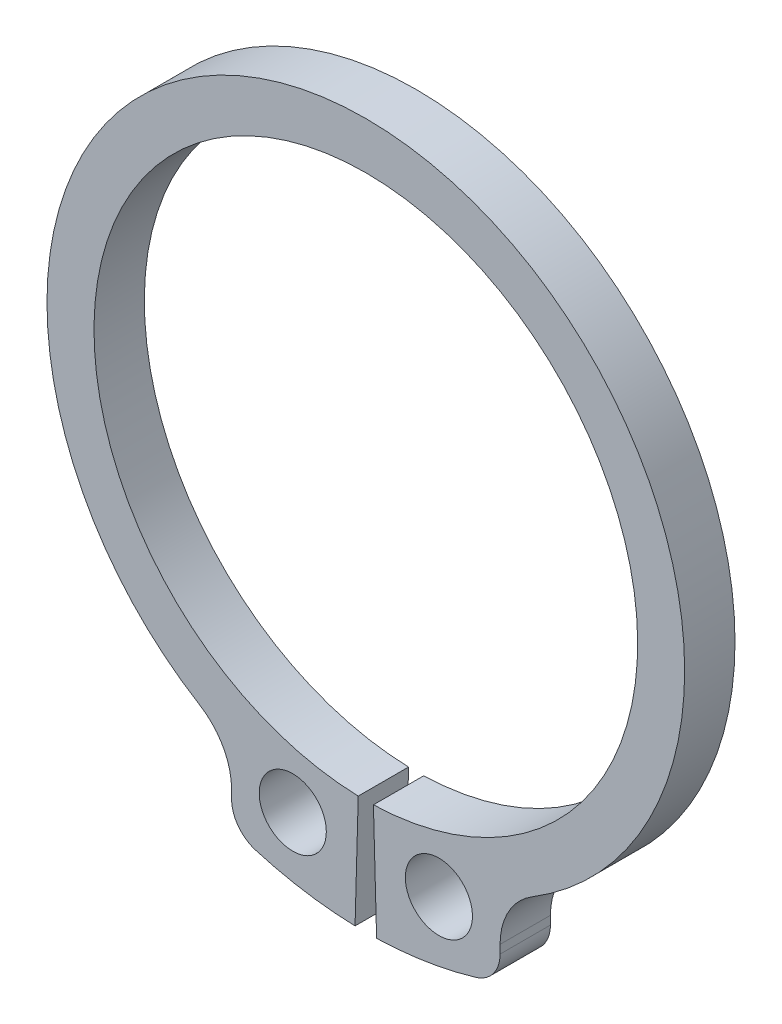
ISO-10303-21;
HEADER;
FILE_DESCRIPTION(('STEP AP214'),'2;1');
FILE_NAME('part.step','',(''),(''),'','','');
FILE_SCHEMA(('AUTOMOTIVE_DESIGN { 1 0 10303 214 1 1 1 1 }'));
ENDSEC;
DATA;
#1=APPLICATION_CONTEXT('core data for automotive mechanical design processes');
#2=APPLICATION_PROTOCOL_DEFINITION('international standard','automotive_design',2000,#1);
#3=PRODUCT_CONTEXT('',#1,'mechanical');
#4=PRODUCT('Part','Part','',(#3));
#5=PRODUCT_RELATED_PRODUCT_CATEGORY('part','',(#4));
#6=PRODUCT_DEFINITION_FORMATION('','',#4);
#7=PRODUCT_DEFINITION_CONTEXT('part definition',#1,'design');
#8=PRODUCT_DEFINITION('design','',#6,#7);
#9=PRODUCT_DEFINITION_SHAPE('','',#8);
#10=(LENGTH_UNIT() NAMED_UNIT(*) SI_UNIT(.MILLI.,.METRE.));
#11=(NAMED_UNIT(*) PLANE_ANGLE_UNIT() SI_UNIT($,.RADIAN.));
#12=(NAMED_UNIT(*) SI_UNIT($,.STERADIAN.) SOLID_ANGLE_UNIT());
#13=UNCERTAINTY_MEASURE_WITH_UNIT(LENGTH_MEASURE(1.E-05),#10,'distance_accuracy_value','');
#14=(GEOMETRIC_REPRESENTATION_CONTEXT(3) GLOBAL_UNCERTAINTY_ASSIGNED_CONTEXT((#13)) GLOBAL_UNIT_ASSIGNED_CONTEXT((#10,
#11,#12)) REPRESENTATION_CONTEXT('',''));
#15=CARTESIAN_POINT('',(0.,0.,0.));
#16=DIRECTION('',(0.,0.,1.));
#17=DIRECTION('',(1.,0.,0.));
#18=AXIS2_PLACEMENT_3D('',#15,#16,#17);
#19=CARTESIAN_POINT('',(6.00000000000004,-9.81070843517422,1.5));
#20=DIRECTION('',(0.,0.,-0.999999999999997));
#21=DIRECTION('',(-1.,0.,0.));
#22=AXIS2_PLACEMENT_3D('',#19,#20,#21);
#23=CYLINDRICAL_SURFACE('',#22,2.);
#24=CARTESIAN_POINT('',(6.00000000000001,-9.81070843517428,0.));
#25=DIRECTION('',(0.,0.,-0.999999999999997));
#26=DIRECTION('',(-1.,0.,0.));
#27=AXIS2_PLACEMENT_3D('',#24,#25,#26);
#28=CIRCLE('',#27,2.);
#29=CARTESIAN_POINT('',(3.99999999999998,-9.81070843517426,0.));
#30=VERTEX_POINT('',#29);
#31=CARTESIAN_POINT('',(4.95652173913042,-8.10449827253529,0.));
#32=VERTEX_POINT('',#31);
#33=EDGE_CURVE('E166',#30,#32,#28,.T.);
#34=ORIENTED_EDGE('',*,*,#33,.T.);
#35=DIRECTION('',(0.,0.,-0.999999999999997));
#36=VECTOR('',#35,1.);
#37=CARTESIAN_POINT('',(4.95652173913046,-8.10449827253524,1.5));
#38=LINE('',#37,#36);
#39=CARTESIAN_POINT('',(4.95652173913046,-8.10449827253524,1.5));
#40=VERTEX_POINT('',#39);
#41=EDGE_CURVE('E13',#40,#32,#38,.T.);
#42=ORIENTED_EDGE('',*,*,#41,.F.);
#43=CARTESIAN_POINT('',(6.00000000000004,-9.81070843517422,1.5));
#44=DIRECTION('',(0.,0.,-0.999999999999997));
#45=DIRECTION('',(-1.,0.,0.));
#46=AXIS2_PLACEMENT_3D('',#43,#44,#45);
#47=CIRCLE('',#46,2.);
#48=CARTESIAN_POINT('',(4.00000000000004,-9.81070843517422,1.5));
#49=VERTEX_POINT('',#48);
#50=EDGE_CURVE('E196',#49,#40,#47,.T.);
#51=ORIENTED_EDGE('',*,*,#50,.F.);
#52=DIRECTION('',(0.,0.,-0.999999999999997));
#53=VECTOR('',#52,1.);
#54=CARTESIAN_POINT('',(4.00000000000004,-9.81070843517422,1.5));
#55=LINE('',#54,#53);
#56=EDGE_CURVE('E162',#49,#30,#55,.T.);
#57=ORIENTED_EDGE('',*,*,#56,.T.);
#58=EDGE_LOOP('',(#34,#42,#51,#57));
#59=FACE_BOUND('',#58,.T.);
#60=ADVANCED_FACE('F46',(#59),#23,.F.);
#61=CARTESIAN_POINT('',(0.,0.,1.5));
#62=DIRECTION('',(0.,0.,-0.999999999999997));
#63=DIRECTION('',(-1.,0.,0.));
#64=AXIS2_PLACEMENT_3D('',#61,#62,#63);
#65=CYLINDRICAL_SURFACE('',#64,9.5);
#66=CARTESIAN_POINT('',(0.,0.,0.));
#67=DIRECTION('',(0.,0.,0.999999999999997));
#68=DIRECTION('',(1.,0.,0.));
#69=AXIS2_PLACEMENT_3D('',#66,#67,#68);
#70=CIRCLE('',#69,9.5);
#71=CARTESIAN_POINT('',(-4.95652173913045,-8.10449827253527,3.33066907387547E-13));
#72=VERTEX_POINT('',#71);
#73=EDGE_CURVE('E169',#32,#72,#70,.T.);
#74=ORIENTED_EDGE('',*,*,#73,.T.);
#75=DIRECTION('',(0.,0.,-0.999999999999997));
#76=VECTOR('',#75,1.);
#77=CARTESIAN_POINT('',(-4.95652173913041,-8.10449827253524,1.50000000000033));
#78=LINE('',#77,#76);
#79=CARTESIAN_POINT('',(-4.95652173913041,-8.10449827253524,1.50000000000033));
#80=VERTEX_POINT('',#79);
#81=EDGE_CURVE('E54',#80,#72,#78,.T.);
#82=ORIENTED_EDGE('',*,*,#81,.F.);
#83=CARTESIAN_POINT('',(0.,0.,1.5));
#84=DIRECTION('',(0.,0.,0.999999999999997));
#85=DIRECTION('',(1.,0.,0.));
#86=AXIS2_PLACEMENT_3D('',#83,#84,#85);
#87=CIRCLE('',#86,9.5);
#88=EDGE_CURVE('E117',#40,#80,#87,.T.);
#89=ORIENTED_EDGE('',*,*,#88,.F.);
#90=ORIENTED_EDGE('',*,*,#41,.T.);
#91=EDGE_LOOP('',(#74,#82,#89,#90));
#92=FACE_BOUND('',#91,.T.);
#93=ADVANCED_FACE('F218',(#92),#65,.T.);
#94=CARTESIAN_POINT('',(-5.99999999999998,-9.81070843517425,1.5));
#95=DIRECTION('',(0.,0.,-0.999999999999997));
#96=DIRECTION('',(-1.,0.,0.));
#97=AXIS2_PLACEMENT_3D('',#94,#95,#96);
#98=CYLINDRICAL_SURFACE('',#97,2.);
#99=CARTESIAN_POINT('',(-6.,-9.81070843517428,0.));
#100=DIRECTION('',(0.,0.,0.999999999999997));
#101=DIRECTION('',(1.,0.,0.));
#102=AXIS2_PLACEMENT_3D('',#99,#100,#101);
#103=CIRCLE('',#102,2.);
#104=CARTESIAN_POINT('',(-4.,-9.81070843517429,0.));
#105=VERTEX_POINT('',#104);
#106=EDGE_CURVE('E173',#105,#72,#103,.T.);
#107=ORIENTED_EDGE('',*,*,#106,.F.);
#108=DIRECTION('',(0.,0.,-0.999999999999997));
#109=VECTOR('',#108,1.);
#110=CARTESIAN_POINT('',(-3.99999999999998,-9.81070843517424,1.5));
#111=LINE('',#110,#109);
#112=CARTESIAN_POINT('',(-3.99999999999998,-9.81070843517424,1.5));
#113=VERTEX_POINT('',#112);
#114=EDGE_CURVE('E211',#113,#105,#111,.T.);
#115=ORIENTED_EDGE('',*,*,#114,.F.);
#116=CARTESIAN_POINT('',(-5.99999999999998,-9.81070843517425,1.5));
#117=DIRECTION('',(0.,0.,0.999999999999997));
#118=DIRECTION('',(1.,0.,0.));
#119=AXIS2_PLACEMENT_3D('',#116,#117,#118);
#120=CIRCLE('',#119,2.);
#121=EDGE_CURVE('E217',#113,#80,#120,.T.);
#122=ORIENTED_EDGE('',*,*,#121,.T.);
#123=ORIENTED_EDGE('',*,*,#81,.T.);
#124=EDGE_LOOP('',(#107,#115,#122,#123));
#125=FACE_BOUND('',#124,.T.);
#126=ADVANCED_FACE('F215',(#125),#98,.F.);
#127=CARTESIAN_POINT('',(-3.99999999999998,-10.062305898749,1.5));
#128=DIRECTION('',(-1.,0.,0.));
#129=DIRECTION('',(0.,0.,0.999999999999997));
#130=AXIS2_PLACEMENT_3D('',#127,#128,#129);
#131=PLANE('',#130);
#132=DIRECTION('',(0.,0.999999999999998,0.));
#133=VECTOR('',#132,1.);
#134=CARTESIAN_POINT('',(-4.,-10.0623058987491,0.));
#135=LINE('',#134,#133);
#136=CARTESIAN_POINT('',(-4.,-10.0623058987491,0.));
#137=VERTEX_POINT('',#136);
#138=EDGE_CURVE('E176',#137,#105,#135,.T.);
#139=ORIENTED_EDGE('',*,*,#138,.F.);
#140=DIRECTION('',(0.,0.,-0.999999999999997));
#141=VECTOR('',#140,1.);
#142=CARTESIAN_POINT('',(-3.99999999999998,-10.062305898749,1.5));
#143=LINE('',#142,#141);
#144=CARTESIAN_POINT('',(-3.99999999999998,-10.062305898749,1.5));
#145=VERTEX_POINT('',#144);
#146=EDGE_CURVE('E209',#145,#137,#143,.T.);
#147=ORIENTED_EDGE('',*,*,#146,.F.);
#148=DIRECTION('',(0.,0.999999999999998,0.));
#149=VECTOR('',#148,1.);
#150=CARTESIAN_POINT('',(-3.99999999999998,-10.062305898749,1.5));
#151=LINE('',#150,#149);
#152=EDGE_CURVE('E230',#145,#113,#151,.T.);
#153=ORIENTED_EDGE('',*,*,#152,.T.);
#154=ORIENTED_EDGE('',*,*,#114,.T.);
#155=EDGE_LOOP('',(#139,#147,#153,#154));
#156=FACE_BOUND('',#155,.T.);
#157=ADVANCED_FACE('F227',(#156),#131,.T.);
#158=CARTESIAN_POINT('',(-2.99999999999997,-10.062305898749,1.5));
#159=DIRECTION('',(0.,0.,-0.999999999999997));
#160=DIRECTION('',(-1.,0.,0.));
#161=AXIS2_PLACEMENT_3D('',#158,#159,#160);
#162=CYLINDRICAL_SURFACE('',#161,1.);
#163=CARTESIAN_POINT('',(-2.99999999999999,-10.062305898749,0.));
#164=DIRECTION('',(0.,0.,-0.999999999999997));
#165=DIRECTION('',(-1.,0.,0.));
#166=AXIS2_PLACEMENT_3D('',#163,#164,#165);
#167=CIRCLE('',#166,1.);
#168=CARTESIAN_POINT('',(-3.28571428571428,-11.0206207462489,0.));
#169=VERTEX_POINT('',#168);
#170=EDGE_CURVE('E179',#169,#137,#167,.T.);
#171=ORIENTED_EDGE('',*,*,#170,.F.);
#172=DIRECTION('',(0.,0.,-0.999999999999997));
#173=VECTOR('',#172,1.);
#174=CARTESIAN_POINT('',(-3.28571428571427,-11.0206207462489,1.5));
#175=LINE('',#174,#173);
#176=CARTESIAN_POINT('',(-3.28571428571427,-11.0206207462489,1.5));
#177=VERTEX_POINT('',#176);
#178=EDGE_CURVE('E207',#177,#169,#175,.T.);
#179=ORIENTED_EDGE('',*,*,#178,.F.);
#180=CARTESIAN_POINT('',(-2.99999999999997,-10.062305898749,1.5));
#181=DIRECTION('',(0.,0.,-0.999999999999997));
#182=DIRECTION('',(-1.,0.,0.));
#183=AXIS2_PLACEMENT_3D('',#180,#181,#182);
#184=CIRCLE('',#183,1.);
#185=EDGE_CURVE('E234',#177,#145,#184,.T.);
#186=ORIENTED_EDGE('',*,*,#185,.T.);
#187=ORIENTED_EDGE('',*,*,#146,.T.);
#188=EDGE_LOOP('',(#171,#179,#186,#187));
#189=FACE_BOUND('',#188,.T.);
#190=ADVANCED_FACE('F274',(#189),#162,.T.);
#191=CARTESIAN_POINT('',(0.,0.,1.5));
#192=DIRECTION('',(0.,0.,-0.999999999999997));
#193=DIRECTION('',(-1.,0.,0.));
#194=AXIS2_PLACEMENT_3D('',#191,#192,#193);
#195=CYLINDRICAL_SURFACE('',#194,11.5);
#196=CARTESIAN_POINT('',(0.,0.,0.));
#197=DIRECTION('',(0.,0.,0.999999999999997));
#198=DIRECTION('',(1.,0.,0.));
#199=AXIS2_PLACEMENT_3D('',#196,#197,#198);
#200=CIRCLE('',#199,11.5);
#201=CARTESIAN_POINT('',(-0.321098845320965,-11.4955163229641,0.));
#202=VERTEX_POINT('',#201);
#203=EDGE_CURVE('E182',#169,#202,#200,.T.);
#204=ORIENTED_EDGE('',*,*,#203,.T.);
#205=DIRECTION('',(0.,0.,-0.999999999999997));
#206=VECTOR('',#205,1.);
#207=CARTESIAN_POINT('',(-0.321098845320937,-11.495516322964,1.5));
#208=LINE('',#207,#206);
#209=CARTESIAN_POINT('',(-0.321098845320937,-11.495516322964,1.5));
#210=VERTEX_POINT('',#209);
#211=EDGE_CURVE('E204',#210,#202,#208,.T.);
#212=ORIENTED_EDGE('',*,*,#211,.F.);
#213=CARTESIAN_POINT('',(0.,0.,1.5));
#214=DIRECTION('',(0.,0.,0.999999999999997));
#215=DIRECTION('',(1.,0.,0.));
#216=AXIS2_PLACEMENT_3D('',#213,#214,#215);
#217=CIRCLE('',#216,11.5);
#218=EDGE_CURVE('E240',#177,#210,#217,.T.);
#219=ORIENTED_EDGE('',*,*,#218,.F.);
#220=ORIENTED_EDGE('',*,*,#178,.T.);
#221=EDGE_LOOP('',(#204,#212,#219,#220));
#222=FACE_BOUND('',#221,.T.);
#223=ADVANCED_FACE('F277',(#222),#195,.T.);
#224=CARTESIAN_POINT('',(-0.32109884532093,-11.495516322964,1.5));
#225=DIRECTION('',(-0.999610115040355,0.0279216387235616,0.));
#226=DIRECTION('',(-0.0279216387235617,-0.999610115040352,0.));
#227=AXIS2_PLACEMENT_3D('',#224,#225,#226);
#228=PLANE('',#227);
#229=DIRECTION('',(0.0279216387235617,0.999610115040352,0.));
#230=VECTOR('',#229,1.);
#231=CARTESIAN_POINT('',(-0.32109884532093,-11.495516322964,0.));
#232=LINE('',#231,#230);
#233=CARTESIAN_POINT('',(-0.226165273660851,-8.09684193182684,0.));
#234=VERTEX_POINT('',#233);
#235=EDGE_CURVE('E184',#202,#234,#232,.T.);
#236=ORIENTED_EDGE('',*,*,#235,.T.);
#237=DIRECTION('',(0.,0.,-0.999999999999997));
#238=VECTOR('',#237,1.);
#239=CARTESIAN_POINT('',(-0.226165273660831,-8.09684193182682,1.5));
#240=LINE('',#239,#238);
#241=CARTESIAN_POINT('',(-0.226165273660831,-8.09684193182682,1.5));
#242=VERTEX_POINT('',#241);
#243=EDGE_CURVE('E202',#242,#234,#240,.T.);
#244=ORIENTED_EDGE('',*,*,#243,.F.);
#245=DIRECTION('',(0.0279216387235617,0.999610115040352,0.));
#246=VECTOR('',#245,1.);
#247=CARTESIAN_POINT('',(-0.32109884532093,-11.495516322964,1.5));
#248=LINE('',#247,#246);
#249=EDGE_CURVE('E242',#210,#242,#248,.T.);
#250=ORIENTED_EDGE('',*,*,#249,.F.);
#251=ORIENTED_EDGE('',*,*,#211,.T.);
#252=EDGE_LOOP('',(#236,#244,#250,#251));
#253=FACE_BOUND('',#252,.T.);
#254=ADVANCED_FACE('F281',(#253),#228,.F.);
#255=CARTESIAN_POINT('',(0.,0.,1.5));
#256=DIRECTION('',(0.,0.,-0.999999999999997));
#257=DIRECTION('',(-1.,0.,0.));
#258=AXIS2_PLACEMENT_3D('',#255,#256,#257);
#259=CYLINDRICAL_SURFACE('',#258,8.1);
#260=CARTESIAN_POINT('',(0.,0.,0.));
#261=DIRECTION('',(0.,0.,0.999999999999997));
#262=DIRECTION('',(1.,0.,0.));
#263=AXIS2_PLACEMENT_3D('',#260,#261,#262);
#264=CIRCLE('',#263,8.1);
#265=CARTESIAN_POINT('',(0.226165273660851,-8.09684193182687,0.));
#266=VERTEX_POINT('',#265);
#267=EDGE_CURVE('E187',#266,#234,#264,.T.);
#268=ORIENTED_EDGE('',*,*,#267,.F.);
#269=DIRECTION('',(0.,0.,-0.999999999999997));
#270=VECTOR('',#269,1.);
#271=CARTESIAN_POINT('',(0.226165273660872,-8.09684193182683,1.5));
#272=LINE('',#271,#270);
#273=CARTESIAN_POINT('',(0.226165273660872,-8.09684193182683,1.5));
#274=VERTEX_POINT('',#273);
#275=EDGE_CURVE('E200',#274,#266,#272,.T.);
#276=ORIENTED_EDGE('',*,*,#275,.F.);
#277=CARTESIAN_POINT('',(0.,0.,1.5));
#278=DIRECTION('',(0.,0.,0.999999999999997));
#279=DIRECTION('',(1.,0.,0.));
#280=AXIS2_PLACEMENT_3D('',#277,#278,#279);
#281=CIRCLE('',#280,8.1);
#282=EDGE_CURVE('E244',#274,#242,#281,.T.);
#283=ORIENTED_EDGE('',*,*,#282,.T.);
#284=ORIENTED_EDGE('',*,*,#243,.T.);
#285=EDGE_LOOP('',(#268,#276,#283,#284));
#286=FACE_BOUND('',#285,.T.);
#287=ADVANCED_FACE('F285',(#286),#259,.F.);
#288=CARTESIAN_POINT('',(0.321098845320979,-11.495516322964,1.5));
#289=DIRECTION('',(-0.999610115040354,-0.0279216387235618,0.));
#290=DIRECTION('',(0.0279216387235617,-0.999610115040352,0.));
#291=AXIS2_PLACEMENT_3D('',#288,#289,#290);
#292=PLANE('',#291);
#293=DIRECTION('',(-0.0279216387235617,0.999610115040352,0.));
#294=VECTOR('',#293,1.);
#295=CARTESIAN_POINT('',(0.321098845320972,-11.495516322964,0.));
#296=LINE('',#295,#294);
#297=CARTESIAN_POINT('',(0.321098845320972,-11.495516322964,0.));
#298=VERTEX_POINT('',#297);
#299=EDGE_CURVE('E190',#298,#266,#296,.T.);
#300=ORIENTED_EDGE('',*,*,#299,.F.);
#301=DIRECTION('',(0.,0.,-0.999999999999997));
#302=VECTOR('',#301,1.);
#303=CARTESIAN_POINT('',(0.321098845320979,-11.495516322964,1.5));
#304=LINE('',#303,#302);
#305=CARTESIAN_POINT('',(0.321098845320979,-11.495516322964,1.5));
#306=VERTEX_POINT('',#305);
#307=EDGE_CURVE('E157',#306,#298,#304,.T.);
#308=ORIENTED_EDGE('',*,*,#307,.F.);
#309=DIRECTION('',(-0.0279216387235617,0.999610115040352,0.));
#310=VECTOR('',#309,1.);
#311=CARTESIAN_POINT('',(0.321098845320979,-11.495516322964,1.5));
#312=LINE('',#311,#310);
#313=EDGE_CURVE('E150',#306,#274,#312,.T.);
#314=ORIENTED_EDGE('',*,*,#313,.T.);
#315=ORIENTED_EDGE('',*,*,#275,.T.);
#316=EDGE_LOOP('',(#300,#308,#314,#315));
#317=FACE_BOUND('',#316,.T.);
#318=ADVANCED_FACE('F248',(#317),#292,.T.);
#319=CARTESIAN_POINT('',(0.,0.,1.5));
#320=DIRECTION('',(0.,0.,-0.999999999999997));
#321=DIRECTION('',(-1.,0.,0.));
#322=AXIS2_PLACEMENT_3D('',#319,#320,#321);
#323=CYLINDRICAL_SURFACE('',#322,11.5);
#324=CARTESIAN_POINT('',(0.,0.,0.));
#325=DIRECTION('',(0.,0.,0.999999999999997));
#326=DIRECTION('',(1.,0.,0.));
#327=AXIS2_PLACEMENT_3D('',#324,#325,#326);
#328=CIRCLE('',#327,11.5);
#329=CARTESIAN_POINT('',(3.28571428571429,-11.020620746249,0.));
#330=VERTEX_POINT('',#329);
#331=EDGE_CURVE('E156',#298,#330,#328,.T.);
#332=ORIENTED_EDGE('',*,*,#331,.T.);
#333=DIRECTION('',(0.,0.,-0.999999999999997));
#334=VECTOR('',#333,1.);
#335=CARTESIAN_POINT('',(3.28571428571431,-11.0206207462489,1.5));
#336=LINE('',#335,#334);
#337=CARTESIAN_POINT('',(3.28571428571431,-11.0206207462489,1.5));
#338=VERTEX_POINT('',#337);
#339=EDGE_CURVE('E153',#338,#330,#336,.T.);
#340=ORIENTED_EDGE('',*,*,#339,.F.);
#341=CARTESIAN_POINT('',(0.,0.,1.5));
#342=DIRECTION('',(0.,0.,0.999999999999997));
#343=DIRECTION('',(1.,0.,0.));
#344=AXIS2_PLACEMENT_3D('',#341,#342,#343);
#345=CIRCLE('',#344,11.5);
#346=EDGE_CURVE('E143',#306,#338,#345,.T.);
#347=ORIENTED_EDGE('',*,*,#346,.F.);
#348=ORIENTED_EDGE('',*,*,#307,.T.);
#349=EDGE_LOOP('',(#332,#340,#347,#348));
#350=FACE_BOUND('',#349,.T.);
#351=ADVANCED_FACE('F154',(#350),#323,.T.);
#352=CARTESIAN_POINT('',(3.00000000000001,-10.062305898749,1.5));
#353=DIRECTION('',(0.,0.,-0.999999999999997));
#354=DIRECTION('',(-1.,0.,0.));
#355=AXIS2_PLACEMENT_3D('',#352,#353,#354);
#356=CYLINDRICAL_SURFACE('',#355,1.);
#357=CARTESIAN_POINT('',(3.00000000000002,-10.062305898749,0.));
#358=DIRECTION('',(0.,0.,0.999999999999997));
#359=DIRECTION('',(1.,0.,0.));
#360=AXIS2_PLACEMENT_3D('',#357,#358,#359);
#361=CIRCLE('',#360,1.);
#362=CARTESIAN_POINT('',(3.99999999999999,-10.062305898749,0.));
#363=VERTEX_POINT('',#362);
#364=EDGE_CURVE('E103',#330,#363,#361,.T.);
#365=ORIENTED_EDGE('',*,*,#364,.T.);
#366=DIRECTION('',(0.,0.,-0.999999999999997));
#367=VECTOR('',#366,1.);
#368=CARTESIAN_POINT('',(4.,-10.062305898749,1.5));
#369=LINE('',#368,#367);
#370=CARTESIAN_POINT('',(4.,-10.062305898749,1.5));
#371=VERTEX_POINT('',#370);
#372=EDGE_CURVE('E158',#371,#363,#369,.T.);
#373=ORIENTED_EDGE('',*,*,#372,.F.);
#374=CARTESIAN_POINT('',(3.00000000000001,-10.062305898749,1.5));
#375=DIRECTION('',(0.,0.,0.999999999999997));
#376=DIRECTION('',(1.,0.,0.));
#377=AXIS2_PLACEMENT_3D('',#374,#375,#376);
#378=CIRCLE('',#377,1.);
#379=EDGE_CURVE('E147',#338,#371,#378,.T.);
#380=ORIENTED_EDGE('',*,*,#379,.F.);
#381=ORIENTED_EDGE('',*,*,#339,.T.);
#382=EDGE_LOOP('',(#365,#373,#380,#381));
#383=FACE_BOUND('',#382,.T.);
#384=ADVANCED_FACE('F160',(#383),#356,.T.);
#385=CARTESIAN_POINT('',(4.,-10.062305898749,1.5));
#386=DIRECTION('',(-1.,0.,0.));
#387=DIRECTION('',(0.,0.,0.999999999999997));
#388=AXIS2_PLACEMENT_3D('',#385,#386,#387);
#389=PLANE('',#388);
#390=DIRECTION('',(0.,0.999999999999998,0.));
#391=VECTOR('',#390,1.);
#392=CARTESIAN_POINT('',(3.99999999999999,-10.062305898749,0.));
#393=LINE('',#392,#391);
#394=EDGE_CURVE('E109',#363,#30,#393,.T.);
#395=ORIENTED_EDGE('',*,*,#394,.T.);
#396=ORIENTED_EDGE('',*,*,#56,.F.);
#397=DIRECTION('',(0.,0.999999999999998,0.));
#398=VECTOR('',#397,1.);
#399=CARTESIAN_POINT('',(4.,-10.062305898749,1.5));
#400=LINE('',#399,#398);
#401=EDGE_CURVE('E62',#371,#49,#400,.T.);
#402=ORIENTED_EDGE('',*,*,#401,.F.);
#403=ORIENTED_EDGE('',*,*,#372,.T.);
#404=EDGE_LOOP('',(#395,#396,#402,#403));
#405=FACE_BOUND('',#404,.T.);
#406=ADVANCED_FACE('F252',(#405),#389,.F.);
#407=CARTESIAN_POINT('',(6.00000000000004,-9.81070843517422,1.5));
#408=DIRECTION('',(0.,0.,-0.999999999999997));
#409=DIRECTION('',(-1.,0.,0.));
#410=AXIS2_PLACEMENT_3D('',#407,#408,#409);
#411=PLANE('',#410);
#412=CARTESIAN_POINT('',(2.17704790340786,-9.49462843593591,1.5));
#413=DIRECTION('',(0.,0.,-0.999999999999997));
#414=DIRECTION('',(-1.,0.,0.));
#415=AXIS2_PLACEMENT_3D('',#412,#413,#414);
#416=CIRCLE('',#415,1.);
#417=CARTESIAN_POINT('',(1.17704790340786,-9.49462843593591,1.5));
#418=VERTEX_POINT('',#417);
#419=EDGE_CURVE('E170',#418,#418,#416,.T.);
#420=ORIENTED_EDGE('',*,*,#419,.T.);
#421=EDGE_LOOP('',(#420));
#422=FACE_BOUND('',#421,.T.);
#423=CARTESIAN_POINT('',(-2.17704790340781,-9.49462843593589,1.5));
#424=DIRECTION('',(0.,0.,-0.999999999999997));
#425=DIRECTION('',(1.,0.,0.));
#426=AXIS2_PLACEMENT_3D('',#423,#424,#425);
#427=CIRCLE('',#426,1.);
#428=CARTESIAN_POINT('',(-1.17704790340781,-9.49462843593589,1.5));
#429=VERTEX_POINT('',#428);
#430=EDGE_CURVE('E337',#429,#429,#427,.T.);
#431=ORIENTED_EDGE('',*,*,#430,.T.);
#432=EDGE_LOOP('',(#431));
#433=FACE_BOUND('',#432,.T.);
#434=ORIENTED_EDGE('',*,*,#50,.T.);
#435=ORIENTED_EDGE('',*,*,#88,.T.);
#436=ORIENTED_EDGE('',*,*,#121,.F.);
#437=ORIENTED_EDGE('',*,*,#152,.F.);
#438=ORIENTED_EDGE('',*,*,#185,.F.);
#439=ORIENTED_EDGE('',*,*,#218,.T.);
#440=ORIENTED_EDGE('',*,*,#249,.T.);
#441=ORIENTED_EDGE('',*,*,#282,.F.);
#442=ORIENTED_EDGE('',*,*,#313,.F.);
#443=ORIENTED_EDGE('',*,*,#346,.T.);
#444=ORIENTED_EDGE('',*,*,#379,.T.);
#445=ORIENTED_EDGE('',*,*,#401,.T.);
#446=EDGE_LOOP('',(#434,#435,#436,#437,#438,#439,#440,#441,#442,#443,#444,#445));
#447=FACE_BOUND('',#446,.T.);
#448=ADVANCED_FACE('F145',(#422,#433,#447),#411,.F.);
#449=CARTESIAN_POINT('',(6.00000000000001,-9.81070843517428,0.));
#450=DIRECTION('',(0.,0.,-0.999999999999997));
#451=DIRECTION('',(-1.,0.,0.));
#452=AXIS2_PLACEMENT_3D('',#449,#450,#451);
#453=PLANE('',#452);
#454=CARTESIAN_POINT('',(2.17704790340781,-9.49462843593592,0.));
#455=DIRECTION('',(0.,0.,-0.999999999999997));
#456=DIRECTION('',(-1.,0.,0.));
#457=AXIS2_PLACEMENT_3D('',#454,#455,#456);
#458=CIRCLE('',#457,1.);
#459=CARTESIAN_POINT('',(1.17704790340781,-9.49462843593592,0.));
#460=VERTEX_POINT('',#459);
#461=EDGE_CURVE('E336',#460,#460,#458,.T.);
#462=ORIENTED_EDGE('',*,*,#461,.F.);
#463=EDGE_LOOP('',(#462));
#464=FACE_BOUND('',#463,.T.);
#465=CARTESIAN_POINT('',(-2.17704790340783,-9.49462843593595,0.));
#466=DIRECTION('',(0.,0.,-0.999999999999997));
#467=DIRECTION('',(1.,0.,0.));
#468=AXIS2_PLACEMENT_3D('',#465,#466,#467);
#469=CIRCLE('',#468,1.);
#470=CARTESIAN_POINT('',(-1.17704790340783,-9.49462843593595,0.));
#471=VERTEX_POINT('',#470);
#472=EDGE_CURVE('E341',#471,#471,#469,.T.);
#473=ORIENTED_EDGE('',*,*,#472,.F.);
#474=EDGE_LOOP('',(#473));
#475=FACE_BOUND('',#474,.T.);
#476=ORIENTED_EDGE('',*,*,#33,.F.);
#477=ORIENTED_EDGE('',*,*,#394,.F.);
#478=ORIENTED_EDGE('',*,*,#364,.F.);
#479=ORIENTED_EDGE('',*,*,#331,.F.);
#480=ORIENTED_EDGE('',*,*,#299,.T.);
#481=ORIENTED_EDGE('',*,*,#267,.T.);
#482=ORIENTED_EDGE('',*,*,#235,.F.);
#483=ORIENTED_EDGE('',*,*,#203,.F.);
#484=ORIENTED_EDGE('',*,*,#170,.T.);
#485=ORIENTED_EDGE('',*,*,#138,.T.);
#486=ORIENTED_EDGE('',*,*,#106,.T.);
#487=ORIENTED_EDGE('',*,*,#73,.F.);
#488=EDGE_LOOP('',(#476,#477,#478,#479,#480,#481,#482,#483,#484,#485,#486,#487));
#489=FACE_BOUND('',#488,.T.);
#490=ADVANCED_FACE('F222',(#464,#475,#489),#453,.T.);
#491=CARTESIAN_POINT('',(-2.17704790340781,-9.49462843593589,1.5));
#492=DIRECTION('',(0.,0.,-0.999999999999997));
#493=DIRECTION('',(-1.,0.,0.));
#494=AXIS2_PLACEMENT_3D('',#491,#492,#493);
#495=CYLINDRICAL_SURFACE('',#494,1.);
#496=ORIENTED_EDGE('',*,*,#430,.F.);
#497=EDGE_LOOP('',(#496));
#498=FACE_BOUND('',#497,.T.);
#499=ORIENTED_EDGE('',*,*,#472,.T.);
#500=EDGE_LOOP('',(#499));
#501=FACE_BOUND('',#500,.T.);
#502=ADVANCED_FACE('F314',(#498,#501),#495,.F.);
#503=CARTESIAN_POINT('',(2.17704790340786,-9.49462843593591,1.5));
#504=DIRECTION('',(0.,0.,-0.999999999999997));
#505=DIRECTION('',(-1.,0.,0.));
#506=AXIS2_PLACEMENT_3D('',#503,#504,#505);
#507=CYLINDRICAL_SURFACE('',#506,1.);
#508=ORIENTED_EDGE('',*,*,#419,.F.);
#509=EDGE_LOOP('',(#508));
#510=FACE_BOUND('',#509,.T.);
#511=ORIENTED_EDGE('',*,*,#461,.T.);
#512=EDGE_LOOP('',(#511));
#513=FACE_BOUND('',#512,.T.);
#514=ADVANCED_FACE('F321',(#510,#513),#507,.F.);
#515=CLOSED_SHELL('',(#60,#93,#126,#157,#190,#223,#254,#287,#318,#351,#384,#406,#448,#490,#502,#514));
#516=MANIFOLD_SOLID_BREP('B2',#515);
#517=ADVANCED_BREP_SHAPE_REPRESENTATION('',(#18,#516),#14);
#518=SHAPE_DEFINITION_REPRESENTATION(#9,#517);
ENDSEC;
END-ISO-10303-21;
